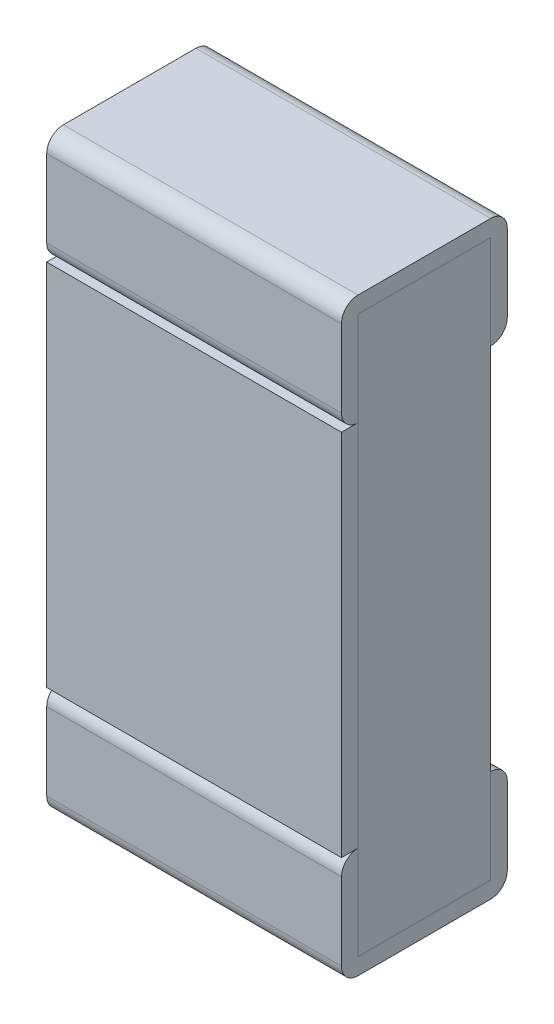
ISO-10303-21;
HEADER;
FILE_DESCRIPTION(('STEP AP214'),'2;1');
FILE_NAME('part.step','',(''),(''),'','','');
FILE_SCHEMA(('AUTOMOTIVE_DESIGN { 1 0 10303 214 1 1 1 1 }'));
ENDSEC;
DATA;
#1=APPLICATION_CONTEXT('core data for automotive mechanical design processes');
#2=APPLICATION_PROTOCOL_DEFINITION('international standard','automotive_design',2000,#1);
#3=PRODUCT_CONTEXT('',#1,'mechanical');
#4=PRODUCT('Part','Part','',(#3));
#5=PRODUCT_RELATED_PRODUCT_CATEGORY('part','',(#4));
#6=PRODUCT_DEFINITION_FORMATION('','',#4);
#7=PRODUCT_DEFINITION_CONTEXT('part definition',#1,'design');
#8=PRODUCT_DEFINITION('design','',#6,#7);
#9=PRODUCT_DEFINITION_SHAPE('','',#8);
#10=(LENGTH_UNIT() NAMED_UNIT(*) SI_UNIT(.MILLI.,.METRE.));
#11=(NAMED_UNIT(*) PLANE_ANGLE_UNIT() SI_UNIT($,.RADIAN.));
#12=(NAMED_UNIT(*) SI_UNIT($,.STERADIAN.) SOLID_ANGLE_UNIT());
#13=UNCERTAINTY_MEASURE_WITH_UNIT(LENGTH_MEASURE(1.E-05),#10,'distance_accuracy_value','');
#14=(GEOMETRIC_REPRESENTATION_CONTEXT(3) GLOBAL_UNCERTAINTY_ASSIGNED_CONTEXT((#13)) GLOBAL_UNIT_ASSIGNED_CONTEXT((#10,
#11,#12)) REPRESENTATION_CONTEXT('',''));
#15=CARTESIAN_POINT('',(0.,0.,0.));
#16=DIRECTION('',(0.,0.,1.));
#17=DIRECTION('',(1.,0.,0.));
#18=AXIS2_PLACEMENT_3D('',#15,#16,#17);
#19=CARTESIAN_POINT('',(152.016744279938,113.07054329235,112.661582908599));
#20=DIRECTION('',(0.,0.,1.));
#21=DIRECTION('',(1.,0.,0.));
#22=AXIS2_PLACEMENT_3D('',#19,#20,#21);
#23=PLANE('',#22);
#24=DIRECTION('',(-1.,0.,0.));
#25=VECTOR('',#24,1.);
#26=CARTESIAN_POINT('',(152.016744279938,113.07054329235,112.661582908599));
#27=LINE('',#26,#25);
#28=CARTESIAN_POINT('',(152.016744279938,113.07054329235,112.661582908599));
#29=VERTEX_POINT('',#28);
#30=CARTESIAN_POINT('',(151.216744279938,113.07054329235,112.661582908599));
#31=VERTEX_POINT('',#30);
#32=EDGE_CURVE('E67',#29,#31,#27,.T.);
#33=ORIENTED_EDGE('',*,*,#32,.F.);
#34=DIRECTION('',(0.,1.,0.));
#35=VECTOR('',#34,1.);
#36=CARTESIAN_POINT('',(152.016744279938,113.07054329235,112.661582908599));
#37=LINE('',#36,#35);
#38=CARTESIAN_POINT('',(152.016744279938,114.07054329235,112.661582908599));
#39=VERTEX_POINT('',#38);
#40=EDGE_CURVE('E11',#29,#39,#37,.T.);
#41=ORIENTED_EDGE('',*,*,#40,.T.);
#42=DIRECTION('',(-1.,0.,0.));
#43=VECTOR('',#42,1.);
#44=CARTESIAN_POINT('',(152.016744279938,114.07054329235,112.661582908599));
#45=LINE('',#44,#43);
#46=CARTESIAN_POINT('',(151.216744279938,114.07054329235,112.661582908599));
#47=VERTEX_POINT('',#46);
#48=EDGE_CURVE('E55',#39,#47,#45,.T.);
#49=ORIENTED_EDGE('',*,*,#48,.T.);
#50=DIRECTION('',(0.,1.,0.));
#51=VECTOR('',#50,1.);
#52=CARTESIAN_POINT('',(151.216744279938,113.07054329235,112.661582908599));
#53=LINE('',#52,#51);
#54=EDGE_CURVE('E365',#31,#47,#53,.T.);
#55=ORIENTED_EDGE('',*,*,#54,.F.);
#56=EDGE_LOOP('',(#33,#41,#49,#55));
#57=FACE_BOUND('',#56,.T.);
#58=ADVANCED_FACE('F44',(#57),#23,.T.);
#59=CARTESIAN_POINT('',(152.016744279938,114.07054329235,112.616582908599));
#60=DIRECTION('',(0.,1.,0.));
#61=DIRECTION('',(1.,0.,0.));
#62=AXIS2_PLACEMENT_3D('',#59,#60,#61);
#63=PLANE('',#62);
#64=DIRECTION('',(0.,0.,1.));
#65=VECTOR('',#64,1.);
#66=CARTESIAN_POINT('',(152.016744279938,114.07054329235,112.616582908599));
#67=LINE('',#66,#65);
#68=CARTESIAN_POINT('',(152.016744279938,114.07054329235,112.616582908599));
#69=VERTEX_POINT('',#68);
#70=EDGE_CURVE('E318',#69,#39,#67,.T.);
#71=ORIENTED_EDGE('',*,*,#70,.F.);
#72=DIRECTION('',(-1.,0.,0.));
#73=VECTOR('',#72,1.);
#74=CARTESIAN_POINT('',(152.016744279938,114.07054329235,112.616582908599));
#75=LINE('',#74,#73);
#76=CARTESIAN_POINT('',(151.216744279938,114.07054329235,112.616582908599));
#77=VERTEX_POINT('',#76);
#78=EDGE_CURVE('E361',#69,#77,#75,.T.);
#79=ORIENTED_EDGE('',*,*,#78,.T.);
#80=DIRECTION('',(0.,0.,1.));
#81=VECTOR('',#80,1.);
#82=CARTESIAN_POINT('',(151.216744279938,114.07054329235,112.616582908599));
#83=LINE('',#82,#81);
#84=EDGE_CURVE('E300',#77,#47,#83,.T.);
#85=ORIENTED_EDGE('',*,*,#84,.T.);
#86=ORIENTED_EDGE('',*,*,#48,.F.);
#87=EDGE_LOOP('',(#71,#79,#85,#86));
#88=FACE_BOUND('',#87,.T.);
#89=ADVANCED_FACE('F396',(#88),#63,.T.);
#90=CARTESIAN_POINT('',(152.016744279938,114.11554329235,112.616582908599));
#91=DIRECTION('',(-1.,0.,0.));
#92=DIRECTION('',(0.,-1.,0.));
#93=AXIS2_PLACEMENT_3D('',#90,#91,#92);
#94=CYLINDRICAL_SURFACE('',#93,0.0450000000000034);
#95=CARTESIAN_POINT('',(152.016744279938,114.11554329235,112.616582908599));
#96=DIRECTION('',(-1.,0.,0.));
#97=DIRECTION('',(0.,0.,1.));
#98=AXIS2_PLACEMENT_3D('',#95,#96,#97);
#99=CIRCLE('',#98,0.0450000000000034);
#100=CARTESIAN_POINT('',(152.016744279938,114.11554329235,112.661582908599));
#101=VERTEX_POINT('',#100);
#102=EDGE_CURVE('E296',#69,#101,#99,.T.);
#103=ORIENTED_EDGE('',*,*,#102,.T.);
#104=DIRECTION('',(-1.,0.,0.));
#105=VECTOR('',#104,1.);
#106=CARTESIAN_POINT('',(152.016744279938,114.11554329235,112.661582908599));
#107=LINE('',#106,#105);
#108=CARTESIAN_POINT('',(151.216744279938,114.11554329235,112.661582908599));
#109=VERTEX_POINT('',#108);
#110=EDGE_CURVE('E301',#101,#109,#107,.T.);
#111=ORIENTED_EDGE('',*,*,#110,.T.);
#112=CARTESIAN_POINT('',(151.216744279938,114.11554329235,112.616582908599));
#113=DIRECTION('',(-1.,0.,0.));
#114=DIRECTION('',(0.,0.,1.));
#115=AXIS2_PLACEMENT_3D('',#112,#113,#114);
#116=CIRCLE('',#115,0.0450000000000034);
#117=EDGE_CURVE('E281',#77,#109,#116,.T.);
#118=ORIENTED_EDGE('',*,*,#117,.F.);
#119=ORIENTED_EDGE('',*,*,#78,.F.);
#120=EDGE_LOOP('',(#103,#111,#118,#119));
#121=FACE_BOUND('',#120,.T.);
#122=ADVANCED_FACE('F577',(#121),#94,.T.);
#123=CARTESIAN_POINT('',(152.016744279938,114.07054329235,112.661582908599));
#124=DIRECTION('',(0.,0.,1.));
#125=DIRECTION('',(1.,0.,0.));
#126=AXIS2_PLACEMENT_3D('',#123,#124,#125);
#127=PLANE('',#126);
#128=DIRECTION('',(0.,1.,0.));
#129=VECTOR('',#128,1.);
#130=CARTESIAN_POINT('',(151.216744279938,114.07054329235,112.661582908599));
#131=LINE('',#130,#129);
#132=CARTESIAN_POINT('',(151.216744279938,114.32554329235,112.661582908599));
#133=VERTEX_POINT('',#132);
#134=EDGE_CURVE('E284',#109,#133,#131,.T.);
#135=ORIENTED_EDGE('',*,*,#134,.F.);
#136=ORIENTED_EDGE('',*,*,#110,.F.);
#137=DIRECTION('',(0.,1.,0.));
#138=VECTOR('',#137,1.);
#139=CARTESIAN_POINT('',(152.016744279938,114.07054329235,112.661582908599));
#140=LINE('',#139,#138);
#141=CARTESIAN_POINT('',(152.016744279938,114.32554329235,112.661582908599));
#142=VERTEX_POINT('',#141);
#143=EDGE_CURVE('E351',#101,#142,#140,.T.);
#144=ORIENTED_EDGE('',*,*,#143,.T.);
#145=DIRECTION('',(-1.,0.,0.));
#146=VECTOR('',#145,1.);
#147=CARTESIAN_POINT('',(152.016744279938,114.32554329235,112.661582908599));
#148=LINE('',#147,#146);
#149=EDGE_CURVE('E359',#142,#133,#148,.T.);
#150=ORIENTED_EDGE('',*,*,#149,.T.);
#151=EDGE_LOOP('',(#135,#136,#144,#150));
#152=FACE_BOUND('',#151,.T.);
#153=ADVANCED_FACE('F495',(#152),#127,.T.);
#154=CARTESIAN_POINT('',(152.016744279938,114.32554329235,112.616582908599));
#155=DIRECTION('',(-1.,0.,0.));
#156=DIRECTION('',(0.,1.,0.));
#157=AXIS2_PLACEMENT_3D('',#154,#155,#156);
#158=CYLINDRICAL_SURFACE('',#157,0.0450000000000034);
#159=DIRECTION('',(-1.,0.,0.));
#160=VECTOR('',#159,1.);
#161=CARTESIAN_POINT('',(152.016744279938,114.37054329235,112.616582908599));
#162=LINE('',#161,#160);
#163=CARTESIAN_POINT('',(152.016744279938,114.37054329235,112.616582908599));
#164=VERTEX_POINT('',#163);
#165=CARTESIAN_POINT('',(151.216744279938,114.37054329235,112.616582908599));
#166=VERTEX_POINT('',#165);
#167=EDGE_CURVE('E355',#164,#166,#162,.T.);
#168=ORIENTED_EDGE('',*,*,#167,.T.);
#169=CARTESIAN_POINT('',(151.216744279938,114.32554329235,112.616582908599));
#170=DIRECTION('',(1.,0.,0.));
#171=DIRECTION('',(0.,0.,1.));
#172=AXIS2_PLACEMENT_3D('',#169,#170,#171);
#173=CIRCLE('',#172,0.0450000000000034);
#174=EDGE_CURVE('E360',#166,#133,#173,.T.);
#175=ORIENTED_EDGE('',*,*,#174,.T.);
#176=ORIENTED_EDGE('',*,*,#149,.F.);
#177=CARTESIAN_POINT('',(152.016744279938,114.32554329235,112.616582908599));
#178=DIRECTION('',(1.,0.,0.));
#179=DIRECTION('',(0.,0.,1.));
#180=AXIS2_PLACEMENT_3D('',#177,#178,#179);
#181=CIRCLE('',#180,0.0450000000000034);
#182=EDGE_CURVE('E275',#164,#142,#181,.T.);
#183=ORIENTED_EDGE('',*,*,#182,.F.);
#184=EDGE_LOOP('',(#168,#175,#176,#183));
#185=FACE_BOUND('',#184,.T.);
#186=ADVANCED_FACE('F498',(#185),#158,.T.);
#187=CARTESIAN_POINT('',(152.016744279938,114.37054329235,112.211582908599));
#188=DIRECTION('',(0.,1.,0.));
#189=DIRECTION('',(1.,0.,0.));
#190=AXIS2_PLACEMENT_3D('',#187,#188,#189);
#191=PLANE('',#190);
#192=DIRECTION('',(0.,0.,1.));
#193=VECTOR('',#192,1.);
#194=CARTESIAN_POINT('',(152.016744279938,114.37054329235,112.211582908599));
#195=LINE('',#194,#193);
#196=CARTESIAN_POINT('',(152.016744279938,114.37054329235,112.256582908599));
#197=VERTEX_POINT('',#196);
#198=EDGE_CURVE('E423',#197,#164,#195,.T.);
#199=ORIENTED_EDGE('',*,*,#198,.F.);
#200=DIRECTION('',(-1.,0.,0.));
#201=VECTOR('',#200,1.);
#202=CARTESIAN_POINT('',(152.016744279938,114.37054329235,112.256582908599));
#203=LINE('',#202,#201);
#204=CARTESIAN_POINT('',(151.216744279938,114.37054329235,112.256582908599));
#205=VERTEX_POINT('',#204);
#206=EDGE_CURVE('E279',#197,#205,#203,.T.);
#207=ORIENTED_EDGE('',*,*,#206,.T.);
#208=DIRECTION('',(0.,0.,1.));
#209=VECTOR('',#208,1.);
#210=CARTESIAN_POINT('',(151.216744279938,114.37054329235,112.211582908599));
#211=LINE('',#210,#209);
#212=EDGE_CURVE('E336',#205,#166,#211,.T.);
#213=ORIENTED_EDGE('',*,*,#212,.T.);
#214=ORIENTED_EDGE('',*,*,#167,.F.);
#215=EDGE_LOOP('',(#199,#207,#213,#214));
#216=FACE_BOUND('',#215,.T.);
#217=ADVANCED_FACE('F503',(#216),#191,.T.);
#218=CARTESIAN_POINT('',(152.016744279938,114.32554329235,112.256582908599));
#219=DIRECTION('',(-1.,0.,0.));
#220=DIRECTION('',(0.,1.,0.));
#221=AXIS2_PLACEMENT_3D('',#218,#219,#220);
#222=CYLINDRICAL_SURFACE('',#221,0.0450000000000034);
#223=CARTESIAN_POINT('',(152.016744279938,114.32554329235,112.256582908599));
#224=DIRECTION('',(-1.,0.,0.));
#225=DIRECTION('',(0.,0.,1.));
#226=AXIS2_PLACEMENT_3D('',#223,#224,#225);
#227=CIRCLE('',#226,0.0450000000000034);
#228=CARTESIAN_POINT('',(152.016744279938,114.32554329235,112.211582908599));
#229=VERTEX_POINT('',#228);
#230=EDGE_CURVE('E340',#197,#229,#227,.T.);
#231=ORIENTED_EDGE('',*,*,#230,.T.);
#232=DIRECTION('',(-1.,0.,0.));
#233=VECTOR('',#232,1.);
#234=CARTESIAN_POINT('',(152.016744279938,114.32554329235,112.211582908599));
#235=LINE('',#234,#233);
#236=CARTESIAN_POINT('',(151.216744279938,114.32554329235,112.211582908599));
#237=VERTEX_POINT('',#236);
#238=EDGE_CURVE('E245',#229,#237,#235,.T.);
#239=ORIENTED_EDGE('',*,*,#238,.T.);
#240=CARTESIAN_POINT('',(151.216744279938,114.32554329235,112.256582908599));
#241=DIRECTION('',(-1.,0.,0.));
#242=DIRECTION('',(0.,0.,1.));
#243=AXIS2_PLACEMENT_3D('',#240,#241,#242);
#244=CIRCLE('',#243,0.0450000000000034);
#245=EDGE_CURVE('E354',#205,#237,#244,.T.);
#246=ORIENTED_EDGE('',*,*,#245,.F.);
#247=ORIENTED_EDGE('',*,*,#206,.F.);
#248=EDGE_LOOP('',(#231,#239,#246,#247));
#249=FACE_BOUND('',#248,.T.);
#250=ADVANCED_FACE('F507',(#249),#222,.T.);
#251=CARTESIAN_POINT('',(152.016744279938,114.07054329235,112.211582908599));
#252=DIRECTION('',(0.,0.,1.));
#253=DIRECTION('',(1.,0.,0.));
#254=AXIS2_PLACEMENT_3D('',#251,#252,#253);
#255=PLANE('',#254);
#256=ORIENTED_EDGE('',*,*,#238,.F.);
#257=DIRECTION('',(0.,1.,0.));
#258=VECTOR('',#257,1.);
#259=CARTESIAN_POINT('',(152.016744279938,114.07054329235,112.211582908599));
#260=LINE('',#259,#258);
#261=CARTESIAN_POINT('',(152.016744279938,114.11554329235,112.211582908599));
#262=VERTEX_POINT('',#261);
#263=EDGE_CURVE('E238',#262,#229,#260,.T.);
#264=ORIENTED_EDGE('',*,*,#263,.F.);
#265=DIRECTION('',(-1.,0.,0.));
#266=VECTOR('',#265,1.);
#267=CARTESIAN_POINT('',(152.016744279938,114.11554329235,112.211582908599));
#268=LINE('',#267,#266);
#269=CARTESIAN_POINT('',(151.216744279938,114.11554329235,112.211582908599));
#270=VERTEX_POINT('',#269);
#271=EDGE_CURVE('E242',#262,#270,#268,.T.);
#272=ORIENTED_EDGE('',*,*,#271,.T.);
#273=DIRECTION('',(0.,1.,0.));
#274=VECTOR('',#273,1.);
#275=CARTESIAN_POINT('',(151.216744279938,114.07054329235,112.211582908599));
#276=LINE('',#275,#274);
#277=EDGE_CURVE('E262',#270,#237,#276,.T.);
#278=ORIENTED_EDGE('',*,*,#277,.T.);
#279=EDGE_LOOP('',(#256,#264,#272,#278));
#280=FACE_BOUND('',#279,.T.);
#281=ADVANCED_FACE('F240',(#280),#255,.F.);
#282=CARTESIAN_POINT('',(152.016744279938,114.11554329235,112.256582908599));
#283=DIRECTION('',(-1.,0.,0.));
#284=DIRECTION('',(0.,-1.,0.));
#285=AXIS2_PLACEMENT_3D('',#282,#283,#284);
#286=CYLINDRICAL_SURFACE('',#285,0.0450000000000034);
#287=DIRECTION('',(-1.,0.,0.));
#288=VECTOR('',#287,1.);
#289=CARTESIAN_POINT('',(152.016744279938,114.07054329235,112.256582908599));
#290=LINE('',#289,#288);
#291=CARTESIAN_POINT('',(152.016744279938,114.07054329235,112.256582908599));
#292=VERTEX_POINT('',#291);
#293=CARTESIAN_POINT('',(151.216744279938,114.07054329235,112.256582908599));
#294=VERTEX_POINT('',#293);
#295=EDGE_CURVE('E325',#292,#294,#290,.T.);
#296=ORIENTED_EDGE('',*,*,#295,.T.);
#297=CARTESIAN_POINT('',(151.216744279938,114.11554329235,112.256582908599));
#298=DIRECTION('',(1.,0.,0.));
#299=DIRECTION('',(0.,0.,1.));
#300=AXIS2_PLACEMENT_3D('',#297,#298,#299);
#301=CIRCLE('',#300,0.0450000000000034);
#302=EDGE_CURVE('E260',#294,#270,#301,.T.);
#303=ORIENTED_EDGE('',*,*,#302,.T.);
#304=ORIENTED_EDGE('',*,*,#271,.F.);
#305=CARTESIAN_POINT('',(152.016744279938,114.11554329235,112.256582908599));
#306=DIRECTION('',(1.,0.,0.));
#307=DIRECTION('',(0.,0.,1.));
#308=AXIS2_PLACEMENT_3D('',#305,#306,#307);
#309=CIRCLE('',#308,0.0450000000000034);
#310=EDGE_CURVE('E251',#292,#262,#309,.T.);
#311=ORIENTED_EDGE('',*,*,#310,.F.);
#312=EDGE_LOOP('',(#296,#303,#304,#311));
#313=FACE_BOUND('',#312,.T.);
#314=ADVANCED_FACE('F257',(#313),#286,.T.);
#315=CARTESIAN_POINT('',(151.216744279938,113.07054329235,112.616582908599));
#316=DIRECTION('',(-1.,0.,0.));
#317=DIRECTION('',(0.,0.,1.));
#318=AXIS2_PLACEMENT_3D('',#315,#316,#317);
#319=PLANE('',#318);
#320=DIRECTION('',(0.,1.,0.));
#321=VECTOR('',#320,1.);
#322=CARTESIAN_POINT('',(151.216744279938,113.07054329235,112.616582908599));
#323=LINE('',#322,#321);
#324=CARTESIAN_POINT('',(151.216744279938,113.07054329235,112.616582908599));
#325=VERTEX_POINT('',#324);
#326=EDGE_CURVE('E404',#325,#77,#323,.T.);
#327=ORIENTED_EDGE('',*,*,#326,.F.);
#328=DIRECTION('',(0.,0.,1.));
#329=VECTOR('',#328,1.);
#330=CARTESIAN_POINT('',(151.216744279938,113.07054329235,112.616582908599));
#331=LINE('',#330,#329);
#332=EDGE_CURVE('E326',#325,#31,#331,.T.);
#333=ORIENTED_EDGE('',*,*,#332,.T.);
#334=ORIENTED_EDGE('',*,*,#54,.T.);
#335=ORIENTED_EDGE('',*,*,#84,.F.);
#336=EDGE_LOOP('',(#327,#333,#334,#335));
#337=FACE_BOUND('',#336,.T.);
#338=ADVANCED_FACE('F402',(#337),#319,.T.);
#339=CARTESIAN_POINT('',(151.216744279938,114.07054329235,112.211582908599));
#340=DIRECTION('',(-1.,0.,0.));
#341=DIRECTION('',(0.,0.,1.));
#342=AXIS2_PLACEMENT_3D('',#339,#340,#341);
#343=PLANE('',#342);
#344=ORIENTED_EDGE('',*,*,#277,.F.);
#345=ORIENTED_EDGE('',*,*,#302,.F.);
#346=DIRECTION('',(0.,1.,0.));
#347=VECTOR('',#346,1.);
#348=CARTESIAN_POINT('',(151.216744279938,112.81554329235,112.256582908599));
#349=LINE('',#348,#347);
#350=CARTESIAN_POINT('',(151.216744279938,114.32554329235,112.256582908599));
#351=VERTEX_POINT('',#350);
#352=EDGE_CURVE('E368',#294,#351,#349,.T.);
#353=ORIENTED_EDGE('',*,*,#352,.T.);
#354=DIRECTION('',(0.,0.,1.));
#355=VECTOR('',#354,1.);
#356=CARTESIAN_POINT('',(151.216744279938,114.32554329235,112.256582908599));
#357=LINE('',#356,#355);
#358=CARTESIAN_POINT('',(151.216744279938,114.32554329235,112.616582908599));
#359=VERTEX_POINT('',#358);
#360=EDGE_CURVE('E283',#351,#359,#357,.T.);
#361=ORIENTED_EDGE('',*,*,#360,.T.);
#362=DIRECTION('',(0.,1.,0.));
#363=VECTOR('',#362,1.);
#364=CARTESIAN_POINT('',(151.216744279938,112.81554329235,112.616582908599));
#365=LINE('',#364,#363);
#366=EDGE_CURVE('E374',#77,#359,#365,.T.);
#367=ORIENTED_EDGE('',*,*,#366,.F.);
#368=ORIENTED_EDGE('',*,*,#117,.T.);
#369=ORIENTED_EDGE('',*,*,#134,.T.);
#370=ORIENTED_EDGE('',*,*,#174,.F.);
#371=ORIENTED_EDGE('',*,*,#212,.F.);
#372=ORIENTED_EDGE('',*,*,#245,.T.);
#373=EDGE_LOOP('',(#344,#345,#353,#361,#367,#368,#369,#370,#371,#372));
#374=FACE_BOUND('',#373,.T.);
#375=ADVANCED_FACE('F492',(#374),#343,.T.);
#376=CARTESIAN_POINT('',(152.016744279938,113.07054329235,112.616582908599));
#377=DIRECTION('',(0.,1.,0.));
#378=DIRECTION('',(1.,0.,0.));
#379=AXIS2_PLACEMENT_3D('',#376,#377,#378);
#380=PLANE('',#379);
#381=ORIENTED_EDGE('',*,*,#32,.T.);
#382=ORIENTED_EDGE('',*,*,#332,.F.);
#383=DIRECTION('',(-1.,0.,0.));
#384=VECTOR('',#383,1.);
#385=CARTESIAN_POINT('',(152.016744279938,113.07054329235,112.616582908599));
#386=LINE('',#385,#384);
#387=CARTESIAN_POINT('',(152.016744279938,113.07054329235,112.616582908599));
#388=VERTEX_POINT('',#387);
#389=EDGE_CURVE('E371',#388,#325,#386,.T.);
#390=ORIENTED_EDGE('',*,*,#389,.F.);
#391=DIRECTION('',(0.,0.,1.));
#392=VECTOR('',#391,1.);
#393=CARTESIAN_POINT('',(152.016744279938,113.07054329235,112.616582908599));
#394=LINE('',#393,#392);
#395=EDGE_CURVE('E314',#388,#29,#394,.T.);
#396=ORIENTED_EDGE('',*,*,#395,.T.);
#397=EDGE_LOOP('',(#381,#382,#390,#396));
#398=FACE_BOUND('',#397,.T.);
#399=ADVANCED_FACE('F564',(#398),#380,.F.);
#400=CARTESIAN_POINT('',(152.016744279938,113.07054329235,112.616582908599));
#401=DIRECTION('',(-1.,0.,0.));
#402=DIRECTION('',(0.,0.,1.));
#403=AXIS2_PLACEMENT_3D('',#400,#401,#402);
#404=PLANE('',#403);
#405=ORIENTED_EDGE('',*,*,#70,.T.);
#406=ORIENTED_EDGE('',*,*,#40,.F.);
#407=ORIENTED_EDGE('',*,*,#395,.F.);
#408=DIRECTION('',(0.,1.,0.));
#409=VECTOR('',#408,1.);
#410=CARTESIAN_POINT('',(152.016744279938,113.07054329235,112.616582908599));
#411=LINE('',#410,#409);
#412=EDGE_CURVE('E420',#388,#69,#411,.T.);
#413=ORIENTED_EDGE('',*,*,#412,.T.);
#414=EDGE_LOOP('',(#405,#406,#407,#413));
#415=FACE_BOUND('',#414,.T.);
#416=ADVANCED_FACE('F574',(#415),#404,.F.);
#417=CARTESIAN_POINT('',(152.016744279938,114.07054329235,112.211582908599));
#418=DIRECTION('',(-1.,0.,0.));
#419=DIRECTION('',(0.,0.,1.));
#420=AXIS2_PLACEMENT_3D('',#417,#418,#419);
#421=PLANE('',#420);
#422=ORIENTED_EDGE('',*,*,#230,.F.);
#423=ORIENTED_EDGE('',*,*,#198,.T.);
#424=ORIENTED_EDGE('',*,*,#182,.T.);
#425=ORIENTED_EDGE('',*,*,#143,.F.);
#426=ORIENTED_EDGE('',*,*,#102,.F.);
#427=DIRECTION('',(0.,1.,0.));
#428=VECTOR('',#427,1.);
#429=CARTESIAN_POINT('',(152.016744279938,112.81554329235,112.616582908599));
#430=LINE('',#429,#428);
#431=CARTESIAN_POINT('',(152.016744279938,114.32554329235,112.616582908599));
#432=VERTEX_POINT('',#431);
#433=EDGE_CURVE('E269',#69,#432,#430,.T.);
#434=ORIENTED_EDGE('',*,*,#433,.T.);
#435=DIRECTION('',(0.,0.,1.));
#436=VECTOR('',#435,1.);
#437=CARTESIAN_POINT('',(152.016744279938,114.32554329235,112.256582908599));
#438=LINE('',#437,#436);
#439=CARTESIAN_POINT('',(152.016744279938,114.32554329235,112.256582908599));
#440=VERTEX_POINT('',#439);
#441=EDGE_CURVE('E319',#440,#432,#438,.T.);
#442=ORIENTED_EDGE('',*,*,#441,.F.);
#443=DIRECTION('',(0.,1.,0.));
#444=VECTOR('',#443,1.);
#445=CARTESIAN_POINT('',(152.016744279938,112.81554329235,112.256582908599));
#446=LINE('',#445,#444);
#447=EDGE_CURVE('E267',#292,#440,#446,.T.);
#448=ORIENTED_EDGE('',*,*,#447,.F.);
#449=ORIENTED_EDGE('',*,*,#310,.T.);
#450=ORIENTED_EDGE('',*,*,#263,.T.);
#451=EDGE_LOOP('',(#422,#423,#424,#425,#426,#434,#442,#448,#449,#450));
#452=FACE_BOUND('',#451,.T.);
#453=ADVANCED_FACE('F265',(#452),#421,.F.);
#454=CARTESIAN_POINT('',(152.016744279938,112.81554329235,112.256582908599));
#455=DIRECTION('',(0.,0.,1.));
#456=DIRECTION('',(1.,0.,0.));
#457=AXIS2_PLACEMENT_3D('',#454,#455,#456);
#458=PLANE('',#457);
#459=DIRECTION('',(0.,1.,0.));
#460=VECTOR('',#459,1.);
#461=CARTESIAN_POINT('',(151.216744279938,112.81554329235,112.256582908599));
#462=LINE('',#461,#460);
#463=CARTESIAN_POINT('',(151.216744279938,113.07054329235,112.256582908599));
#464=VERTEX_POINT('',#463);
#465=EDGE_CURVE('E252',#464,#294,#462,.T.);
#466=ORIENTED_EDGE('',*,*,#465,.T.);
#467=ORIENTED_EDGE('',*,*,#295,.F.);
#468=DIRECTION('',(0.,1.,0.));
#469=VECTOR('',#468,1.);
#470=CARTESIAN_POINT('',(152.016744279938,112.81554329235,112.256582908599));
#471=LINE('',#470,#469);
#472=CARTESIAN_POINT('',(152.016744279938,113.07054329235,112.256582908599));
#473=VERTEX_POINT('',#472);
#474=EDGE_CURVE('E343',#473,#292,#471,.T.);
#475=ORIENTED_EDGE('',*,*,#474,.F.);
#476=DIRECTION('',(-1.,0.,0.));
#477=VECTOR('',#476,1.);
#478=CARTESIAN_POINT('',(152.016744279938,113.07054329235,112.256582908599));
#479=LINE('',#478,#477);
#480=EDGE_CURVE('E48',#473,#464,#479,.T.);
#481=ORIENTED_EDGE('',*,*,#480,.T.);
#482=EDGE_LOOP('',(#466,#467,#475,#481));
#483=FACE_BOUND('',#482,.T.);
#484=ADVANCED_FACE('F551',(#483),#458,.F.);
#485=CARTESIAN_POINT('',(151.216744279938,112.81554329235,112.256582908599));
#486=DIRECTION('',(-1.,0.,0.));
#487=DIRECTION('',(0.,0.,1.));
#488=AXIS2_PLACEMENT_3D('',#485,#486,#487);
#489=PLANE('',#488);
#490=DIRECTION('',(0.,1.,0.));
#491=VECTOR('',#490,1.);
#492=CARTESIAN_POINT('',(151.216744279938,112.81554329235,112.256582908599));
#493=LINE('',#492,#491);
#494=CARTESIAN_POINT('',(151.216744279938,112.81554329235,112.256582908599));
#495=VERTEX_POINT('',#494);
#496=EDGE_CURVE('E330',#495,#464,#493,.T.);
#497=ORIENTED_EDGE('',*,*,#496,.F.);
#498=DIRECTION('',(0.,0.,1.));
#499=VECTOR('',#498,1.);
#500=CARTESIAN_POINT('',(151.216744279938,112.81554329235,112.256582908599));
#501=LINE('',#500,#499);
#502=CARTESIAN_POINT('',(151.216744279938,112.81554329235,112.616582908599));
#503=VERTEX_POINT('',#502);
#504=EDGE_CURVE('E467',#495,#503,#501,.T.);
#505=ORIENTED_EDGE('',*,*,#504,.T.);
#506=DIRECTION('',(0.,1.,0.));
#507=VECTOR('',#506,1.);
#508=CARTESIAN_POINT('',(151.216744279938,112.81554329235,112.616582908599));
#509=LINE('',#508,#507);
#510=EDGE_CURVE('E460',#503,#325,#509,.T.);
#511=ORIENTED_EDGE('',*,*,#510,.T.);
#512=ORIENTED_EDGE('',*,*,#326,.T.);
#513=ORIENTED_EDGE('',*,*,#366,.T.);
#514=ORIENTED_EDGE('',*,*,#360,.F.);
#515=ORIENTED_EDGE('',*,*,#352,.F.);
#516=ORIENTED_EDGE('',*,*,#465,.F.);
#517=EDGE_LOOP('',(#497,#505,#511,#512,#513,#514,#515,#516));
#518=FACE_BOUND('',#517,.T.);
#519=ADVANCED_FACE('F555',(#518),#489,.T.);
#520=CARTESIAN_POINT('',(152.016744279938,113.02554329235,112.616582908599));
#521=DIRECTION('',(-1.,0.,0.));
#522=DIRECTION('',(0.,1.,0.));
#523=AXIS2_PLACEMENT_3D('',#520,#521,#522);
#524=CYLINDRICAL_SURFACE('',#523,0.0450000000000034);
#525=ORIENTED_EDGE('',*,*,#389,.T.);
#526=CARTESIAN_POINT('',(151.216744279938,113.02554329235,112.616582908599));
#527=DIRECTION('',(1.,0.,0.));
#528=DIRECTION('',(0.,0.,1.));
#529=AXIS2_PLACEMENT_3D('',#526,#527,#528);
#530=CIRCLE('',#529,0.0450000000000034);
#531=CARTESIAN_POINT('',(151.216744279938,113.02554329235,112.661582908599));
#532=VERTEX_POINT('',#531);
#533=EDGE_CURVE('E375',#325,#532,#530,.T.);
#534=ORIENTED_EDGE('',*,*,#533,.T.);
#535=DIRECTION('',(-1.,0.,0.));
#536=VECTOR('',#535,1.);
#537=CARTESIAN_POINT('',(152.016744279938,113.02554329235,112.661582908599));
#538=LINE('',#537,#536);
#539=CARTESIAN_POINT('',(152.016744279938,113.02554329235,112.661582908599));
#540=VERTEX_POINT('',#539);
#541=EDGE_CURVE('E347',#540,#532,#538,.T.);
#542=ORIENTED_EDGE('',*,*,#541,.F.);
#543=CARTESIAN_POINT('',(152.016744279938,113.02554329235,112.616582908599));
#544=DIRECTION('',(1.,0.,0.));
#545=DIRECTION('',(0.,0.,1.));
#546=AXIS2_PLACEMENT_3D('',#543,#544,#545);
#547=CIRCLE('',#546,0.0450000000000034);
#548=EDGE_CURVE('E295',#388,#540,#547,.T.);
#549=ORIENTED_EDGE('',*,*,#548,.F.);
#550=EDGE_LOOP('',(#525,#534,#542,#549));
#551=FACE_BOUND('',#550,.T.);
#552=ADVANCED_FACE('F570',(#551),#524,.T.);
#553=CARTESIAN_POINT('',(152.016744279938,112.77054329235,112.661582908599));
#554=DIRECTION('',(0.,0.,1.));
#555=DIRECTION('',(1.,0.,0.));
#556=AXIS2_PLACEMENT_3D('',#553,#554,#555);
#557=PLANE('',#556);
#558=DIRECTION('',(0.,1.,0.));
#559=VECTOR('',#558,1.);
#560=CARTESIAN_POINT('',(151.216744279938,112.77054329235,112.661582908599));
#561=LINE('',#560,#559);
#562=CARTESIAN_POINT('',(151.216744279938,112.81554329235,112.661582908599));
#563=VERTEX_POINT('',#562);
#564=EDGE_CURVE('E335',#563,#532,#561,.T.);
#565=ORIENTED_EDGE('',*,*,#564,.F.);
#566=DIRECTION('',(-1.,0.,0.));
#567=VECTOR('',#566,1.);
#568=CARTESIAN_POINT('',(152.016744279938,112.81554329235,112.661582908599));
#569=LINE('',#568,#567);
#570=CARTESIAN_POINT('',(152.016744279938,112.81554329235,112.661582908599));
#571=VERTEX_POINT('',#570);
#572=EDGE_CURVE('E285',#571,#563,#569,.T.);
#573=ORIENTED_EDGE('',*,*,#572,.F.);
#574=DIRECTION('',(0.,1.,0.));
#575=VECTOR('',#574,1.);
#576=CARTESIAN_POINT('',(152.016744279938,112.77054329235,112.661582908599));
#577=LINE('',#576,#575);
#578=EDGE_CURVE('E419',#571,#540,#577,.T.);
#579=ORIENTED_EDGE('',*,*,#578,.T.);
#580=ORIENTED_EDGE('',*,*,#541,.T.);
#581=EDGE_LOOP('',(#565,#573,#579,#580));
#582=FACE_BOUND('',#581,.T.);
#583=ADVANCED_FACE('F614',(#582),#557,.T.);
#584=CARTESIAN_POINT('',(152.016744279938,112.81554329235,112.256582908599));
#585=DIRECTION('',(-1.,0.,0.));
#586=DIRECTION('',(0.,0.,1.));
#587=AXIS2_PLACEMENT_3D('',#584,#585,#586);
#588=PLANE('',#587);
#589=ORIENTED_EDGE('',*,*,#474,.T.);
#590=ORIENTED_EDGE('',*,*,#447,.T.);
#591=ORIENTED_EDGE('',*,*,#441,.T.);
#592=ORIENTED_EDGE('',*,*,#433,.F.);
#593=ORIENTED_EDGE('',*,*,#412,.F.);
#594=DIRECTION('',(0.,1.,0.));
#595=VECTOR('',#594,1.);
#596=CARTESIAN_POINT('',(152.016744279938,112.81554329235,112.616582908599));
#597=LINE('',#596,#595);
#598=CARTESIAN_POINT('',(152.016744279938,112.81554329235,112.616582908599));
#599=VERTEX_POINT('',#598);
#600=EDGE_CURVE('E290',#599,#388,#597,.T.);
#601=ORIENTED_EDGE('',*,*,#600,.F.);
#602=DIRECTION('',(0.,0.,1.));
#603=VECTOR('',#602,1.);
#604=CARTESIAN_POINT('',(152.016744279938,112.81554329235,112.256582908599));
#605=LINE('',#604,#603);
#606=CARTESIAN_POINT('',(152.016744279938,112.81554329235,112.256582908599));
#607=VERTEX_POINT('',#606);
#608=EDGE_CURVE('E294',#607,#599,#605,.T.);
#609=ORIENTED_EDGE('',*,*,#608,.F.);
#610=DIRECTION('',(0.,1.,0.));
#611=VECTOR('',#610,1.);
#612=CARTESIAN_POINT('',(152.016744279938,112.81554329235,112.256582908599));
#613=LINE('',#612,#611);
#614=EDGE_CURVE('E306',#607,#473,#613,.T.);
#615=ORIENTED_EDGE('',*,*,#614,.T.);
#616=EDGE_LOOP('',(#589,#590,#591,#592,#593,#601,#609,#615));
#617=FACE_BOUND('',#616,.T.);
#618=ADVANCED_FACE('F549',(#617),#588,.F.);
#619=CARTESIAN_POINT('',(152.016744279938,113.02554329235,112.256582908599));
#620=DIRECTION('',(-1.,0.,0.));
#621=DIRECTION('',(0.,1.,0.));
#622=AXIS2_PLACEMENT_3D('',#619,#620,#621);
#623=CYLINDRICAL_SURFACE('',#622,0.0450000000000034);
#624=CARTESIAN_POINT('',(152.016744279938,113.02554329235,112.256582908599));
#625=DIRECTION('',(-1.,0.,0.));
#626=DIRECTION('',(0.,0.,1.));
#627=AXIS2_PLACEMENT_3D('',#624,#625,#626);
#628=CIRCLE('',#627,0.0450000000000034);
#629=CARTESIAN_POINT('',(152.016744279938,113.02554329235,112.211582908599));
#630=VERTEX_POINT('',#629);
#631=EDGE_CURVE('E302',#473,#630,#628,.T.);
#632=ORIENTED_EDGE('',*,*,#631,.T.);
#633=DIRECTION('',(-1.,0.,0.));
#634=VECTOR('',#633,1.);
#635=CARTESIAN_POINT('',(152.016744279938,113.02554329235,112.211582908599));
#636=LINE('',#635,#634);
#637=CARTESIAN_POINT('',(151.216744279938,113.02554329235,112.211582908599));
#638=VERTEX_POINT('',#637);
#639=EDGE_CURVE('E307',#630,#638,#636,.T.);
#640=ORIENTED_EDGE('',*,*,#639,.T.);
#641=CARTESIAN_POINT('',(151.216744279938,113.02554329235,112.256582908599));
#642=DIRECTION('',(-1.,0.,0.));
#643=DIRECTION('',(0.,0.,1.));
#644=AXIS2_PLACEMENT_3D('',#641,#642,#643);
#645=CIRCLE('',#644,0.0450000000000034);
#646=EDGE_CURVE('E327',#464,#638,#645,.T.);
#647=ORIENTED_EDGE('',*,*,#646,.F.);
#648=ORIENTED_EDGE('',*,*,#480,.F.);
#649=EDGE_LOOP('',(#632,#640,#647,#648));
#650=FACE_BOUND('',#649,.T.);
#651=ADVANCED_FACE('F544',(#650),#623,.T.);
#652=CARTESIAN_POINT('',(152.016744279938,112.77054329235,112.211582908599));
#653=DIRECTION('',(0.,0.,1.));
#654=DIRECTION('',(1.,0.,0.));
#655=AXIS2_PLACEMENT_3D('',#652,#653,#654);
#656=PLANE('',#655);
#657=ORIENTED_EDGE('',*,*,#639,.F.);
#658=DIRECTION('',(0.,1.,0.));
#659=VECTOR('',#658,1.);
#660=CARTESIAN_POINT('',(152.016744279938,112.77054329235,112.211582908599));
#661=LINE('',#660,#659);
#662=CARTESIAN_POINT('',(152.016744279938,112.81554329235,112.211582908599));
#663=VERTEX_POINT('',#662);
#664=EDGE_CURVE('E387',#663,#630,#661,.T.);
#665=ORIENTED_EDGE('',*,*,#664,.F.);
#666=DIRECTION('',(-1.,0.,0.));
#667=VECTOR('',#666,1.);
#668=CARTESIAN_POINT('',(152.016744279938,112.81554329235,112.211582908599));
#669=LINE('',#668,#667);
#670=CARTESIAN_POINT('',(151.216744279938,112.81554329235,112.211582908599));
#671=VERTEX_POINT('',#670);
#672=EDGE_CURVE('E312',#663,#671,#669,.T.);
#673=ORIENTED_EDGE('',*,*,#672,.T.);
#674=DIRECTION('',(0.,1.,0.));
#675=VECTOR('',#674,1.);
#676=CARTESIAN_POINT('',(151.216744279938,112.77054329235,112.211582908599));
#677=LINE('',#676,#675);
#678=EDGE_CURVE('E308',#671,#638,#677,.T.);
#679=ORIENTED_EDGE('',*,*,#678,.T.);
#680=EDGE_LOOP('',(#657,#665,#673,#679));
#681=FACE_BOUND('',#680,.T.);
#682=ADVANCED_FACE('F540',(#681),#656,.F.);
#683=CARTESIAN_POINT('',(151.216744279938,112.77054329235,112.211582908599));
#684=DIRECTION('',(-1.,0.,0.));
#685=DIRECTION('',(0.,0.,1.));
#686=AXIS2_PLACEMENT_3D('',#683,#684,#685);
#687=PLANE('',#686);
#688=ORIENTED_EDGE('',*,*,#678,.F.);
#689=CARTESIAN_POINT('',(151.216744279938,112.81554329235,112.256582908599));
#690=DIRECTION('',(1.,0.,0.));
#691=DIRECTION('',(0.,0.,1.));
#692=AXIS2_PLACEMENT_3D('',#689,#690,#691);
#693=CIRCLE('',#692,0.0450000000000034);
#694=CARTESIAN_POINT('',(151.216744279938,112.77054329235,112.256582908599));
#695=VERTEX_POINT('',#694);
#696=EDGE_CURVE('E424',#695,#671,#693,.T.);
#697=ORIENTED_EDGE('',*,*,#696,.F.);
#698=DIRECTION('',(0.,0.,1.));
#699=VECTOR('',#698,1.);
#700=CARTESIAN_POINT('',(151.216744279938,112.77054329235,112.211582908599));
#701=LINE('',#700,#699);
#702=CARTESIAN_POINT('',(151.216744279938,112.77054329235,112.616582908599));
#703=VERTEX_POINT('',#702);
#704=EDGE_CURVE('E313',#695,#703,#701,.T.);
#705=ORIENTED_EDGE('',*,*,#704,.T.);
#706=CARTESIAN_POINT('',(151.216744279938,112.81554329235,112.616582908599));
#707=DIRECTION('',(-1.,0.,0.));
#708=DIRECTION('',(0.,0.,1.));
#709=AXIS2_PLACEMENT_3D('',#706,#707,#708);
#710=CIRCLE('',#709,0.0450000000000034);
#711=EDGE_CURVE('E331',#703,#563,#710,.T.);
#712=ORIENTED_EDGE('',*,*,#711,.T.);
#713=ORIENTED_EDGE('',*,*,#564,.T.);
#714=ORIENTED_EDGE('',*,*,#533,.F.);
#715=ORIENTED_EDGE('',*,*,#510,.F.);
#716=ORIENTED_EDGE('',*,*,#504,.F.);
#717=ORIENTED_EDGE('',*,*,#496,.T.);
#718=ORIENTED_EDGE('',*,*,#646,.T.);
#719=EDGE_LOOP('',(#688,#697,#705,#712,#713,#714,#715,#716,#717,#718));
#720=FACE_BOUND('',#719,.T.);
#721=ADVANCED_FACE('F559',(#720),#687,.T.);
#722=CARTESIAN_POINT('',(152.016744279938,112.81554329235,112.616582908599));
#723=DIRECTION('',(-1.,0.,0.));
#724=DIRECTION('',(0.,-1.,0.));
#725=AXIS2_PLACEMENT_3D('',#722,#723,#724);
#726=CYLINDRICAL_SURFACE('',#725,0.0450000000000034);
#727=CARTESIAN_POINT('',(152.016744279938,112.81554329235,112.616582908599));
#728=DIRECTION('',(-1.,0.,0.));
#729=DIRECTION('',(0.,0.,1.));
#730=AXIS2_PLACEMENT_3D('',#727,#728,#729);
#731=CIRCLE('',#730,0.0450000000000034);
#732=CARTESIAN_POINT('',(152.016744279938,112.77054329235,112.616582908599));
#733=VERTEX_POINT('',#732);
#734=EDGE_CURVE('E287',#733,#571,#731,.T.);
#735=ORIENTED_EDGE('',*,*,#734,.T.);
#736=ORIENTED_EDGE('',*,*,#572,.T.);
#737=ORIENTED_EDGE('',*,*,#711,.F.);
#738=DIRECTION('',(-1.,0.,0.));
#739=VECTOR('',#738,1.);
#740=CARTESIAN_POINT('',(152.016744279938,112.77054329235,112.616582908599));
#741=LINE('',#740,#739);
#742=EDGE_CURVE('E384',#733,#703,#741,.T.);
#743=ORIENTED_EDGE('',*,*,#742,.F.);
#744=EDGE_LOOP('',(#735,#736,#737,#743));
#745=FACE_BOUND('',#744,.T.);
#746=ADVANCED_FACE('F529',(#745),#726,.T.);
#747=CARTESIAN_POINT('',(152.016744279938,112.81554329235,112.256582908599));
#748=DIRECTION('',(-1.,0.,0.));
#749=DIRECTION('',(0.,-1.,0.));
#750=AXIS2_PLACEMENT_3D('',#747,#748,#749);
#751=CYLINDRICAL_SURFACE('',#750,0.0450000000000034);
#752=DIRECTION('',(-1.,0.,0.));
#753=VECTOR('',#752,1.);
#754=CARTESIAN_POINT('',(152.016744279938,112.77054329235,112.256582908599));
#755=LINE('',#754,#753);
#756=CARTESIAN_POINT('',(152.016744279938,112.77054329235,112.256582908599));
#757=VERTEX_POINT('',#756);
#758=EDGE_CURVE('E288',#757,#695,#755,.T.);
#759=ORIENTED_EDGE('',*,*,#758,.T.);
#760=ORIENTED_EDGE('',*,*,#696,.T.);
#761=ORIENTED_EDGE('',*,*,#672,.F.);
#762=CARTESIAN_POINT('',(152.016744279938,112.81554329235,112.256582908599));
#763=DIRECTION('',(1.,0.,0.));
#764=DIRECTION('',(0.,0.,1.));
#765=AXIS2_PLACEMENT_3D('',#762,#763,#764);
#766=CIRCLE('',#765,0.0450000000000034);
#767=EDGE_CURVE('E429',#757,#663,#766,.T.);
#768=ORIENTED_EDGE('',*,*,#767,.F.);
#769=EDGE_LOOP('',(#759,#760,#761,#768));
#770=FACE_BOUND('',#769,.T.);
#771=ADVANCED_FACE('F46',(#770),#751,.T.);
#772=CARTESIAN_POINT('',(152.016744279938,112.77054329235,112.211582908599));
#773=DIRECTION('',(-1.,0.,0.));
#774=DIRECTION('',(0.,0.,1.));
#775=AXIS2_PLACEMENT_3D('',#772,#773,#774);
#776=PLANE('',#775);
#777=ORIENTED_EDGE('',*,*,#631,.F.);
#778=ORIENTED_EDGE('',*,*,#614,.F.);
#779=ORIENTED_EDGE('',*,*,#608,.T.);
#780=ORIENTED_EDGE('',*,*,#600,.T.);
#781=ORIENTED_EDGE('',*,*,#548,.T.);
#782=ORIENTED_EDGE('',*,*,#578,.F.);
#783=ORIENTED_EDGE('',*,*,#734,.F.);
#784=DIRECTION('',(0.,0.,1.));
#785=VECTOR('',#784,1.);
#786=CARTESIAN_POINT('',(152.016744279938,112.77054329235,112.211582908599));
#787=LINE('',#786,#785);
#788=EDGE_CURVE('E388',#757,#733,#787,.T.);
#789=ORIENTED_EDGE('',*,*,#788,.F.);
#790=ORIENTED_EDGE('',*,*,#767,.T.);
#791=ORIENTED_EDGE('',*,*,#664,.T.);
#792=EDGE_LOOP('',(#777,#778,#779,#780,#781,#782,#783,#789,#790,#791));
#793=FACE_BOUND('',#792,.T.);
#794=ADVANCED_FACE('F532',(#793),#776,.F.);
#795=CARTESIAN_POINT('',(152.016744279938,112.77054329235,112.211582908599));
#796=DIRECTION('',(0.,1.,0.));
#797=DIRECTION('',(1.,0.,0.));
#798=AXIS2_PLACEMENT_3D('',#795,#796,#797);
#799=PLANE('',#798);
#800=ORIENTED_EDGE('',*,*,#742,.T.);
#801=ORIENTED_EDGE('',*,*,#704,.F.);
#802=ORIENTED_EDGE('',*,*,#758,.F.);
#803=ORIENTED_EDGE('',*,*,#788,.T.);
#804=EDGE_LOOP('',(#800,#801,#802,#803));
#805=FACE_BOUND('',#804,.T.);
#806=ADVANCED_FACE('F535',(#805),#799,.F.);
#807=CLOSED_SHELL('',(#58,#89,#122,#153,#186,#217,#250,#281,#314,#338,#375,#399,#416,#453,#484,
#519,#552,#583,#618,#651,#682,#721,#746,#771,#794,#806));
#808=MANIFOLD_SOLID_BREP('B2',#807);
#809=ADVANCED_BREP_SHAPE_REPRESENTATION('',(#18,#808),#14);
#810=SHAPE_DEFINITION_REPRESENTATION(#9,#809);
ENDSEC;
END-ISO-10303-21;
